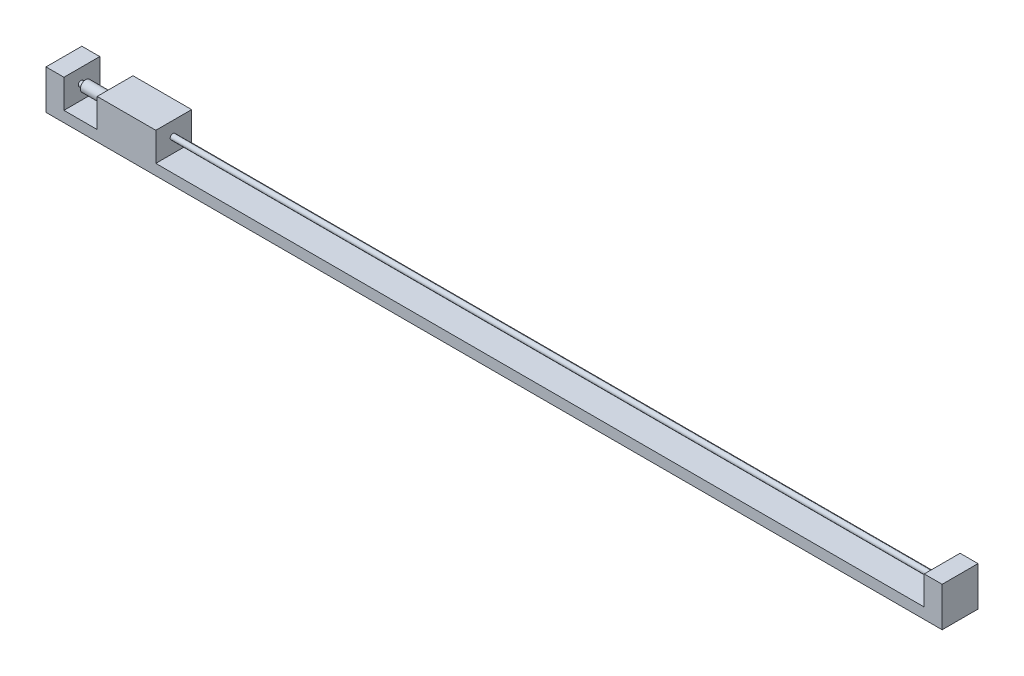
ISO-10303-21;
HEADER;
FILE_DESCRIPTION(('STEP AP214'),'2;1');
FILE_NAME('part.step','',(''),(''),'','','');
FILE_SCHEMA(('AUTOMOTIVE_DESIGN { 1 0 10303 214 1 1 1 1 }'));
ENDSEC;
DATA;
#1=APPLICATION_CONTEXT('core data for automotive mechanical design processes');
#2=APPLICATION_PROTOCOL_DEFINITION('international standard','automotive_design',2000,#1);
#3=PRODUCT_CONTEXT('',#1,'mechanical');
#4=PRODUCT('Part','Part','',(#3));
#5=PRODUCT_RELATED_PRODUCT_CATEGORY('part','',(#4));
#6=PRODUCT_DEFINITION_FORMATION('','',#4);
#7=PRODUCT_DEFINITION_CONTEXT('part definition',#1,'design');
#8=PRODUCT_DEFINITION('design','',#6,#7);
#9=PRODUCT_DEFINITION_SHAPE('','',#8);
#10=(LENGTH_UNIT() NAMED_UNIT(*) SI_UNIT(.MILLI.,.METRE.));
#11=(NAMED_UNIT(*) PLANE_ANGLE_UNIT() SI_UNIT($,.RADIAN.));
#12=(NAMED_UNIT(*) SI_UNIT($,.STERADIAN.) SOLID_ANGLE_UNIT());
#13=UNCERTAINTY_MEASURE_WITH_UNIT(LENGTH_MEASURE(1.E-05),#10,'distance_accuracy_value','');
#14=(GEOMETRIC_REPRESENTATION_CONTEXT(3) GLOBAL_UNCERTAINTY_ASSIGNED_CONTEXT((#13)) GLOBAL_UNIT_ASSIGNED_CONTEXT((#10,
#11,#12)) REPRESENTATION_CONTEXT('',''));
#15=CARTESIAN_POINT('',(0.,0.,0.));
#16=DIRECTION('',(0.,0.,1.));
#17=DIRECTION('',(1.,0.,0.));
#18=AXIS2_PLACEMENT_3D('',#15,#16,#17);
#19=CARTESIAN_POINT('',(14.2707220254308,11.,-10.));
#20=DIRECTION('',(1.,0.,0.));
#21=DIRECTION('',(0.,0.,-1.));
#22=AXIS2_PLACEMENT_3D('',#19,#20,#21);
#23=PLANE('',#22);
#24=CARTESIAN_POINT('',(14.2707220254308,7.10077280639586,-4.7549055990206));
#25=DIRECTION('',(1.,0.,0.));
#26=DIRECTION('',(0.,0.,-1.));
#27=AXIS2_PLACEMENT_3D('',#24,#25,#26);
#28=CIRCLE('',#27,0.75);
#29=CARTESIAN_POINT('',(14.2707220254308,7.10077280639586,-5.5049055990206));
#30=VERTEX_POINT('',#29);
#31=EDGE_CURVE('E48',#30,#30,#28,.T.);
#32=ORIENTED_EDGE('',*,*,#31,.T.);
#33=EDGE_LOOP('',(#32));
#34=FACE_BOUND('',#33,.T.);
#35=CARTESIAN_POINT('',(14.2707220254308,7.16204640664232,-4.80086079920424));
#36=DIRECTION('',(-1.,0.,0.));
#37=DIRECTION('',(0.,0.,1.));
#38=AXIS2_PLACEMENT_3D('',#35,#36,#37);
#39=CIRCLE('',#38,1.15336464905424);
#40=CARTESIAN_POINT('',(14.2707220254308,7.16204640664232,-3.64749615015));
#41=VERTEX_POINT('',#40);
#42=EDGE_CURVE('E508',#41,#41,#39,.T.);
#43=ORIENTED_EDGE('',*,*,#42,.T.);
#44=EDGE_LOOP('',(#43));
#45=FACE_BOUND('',#44,.T.);
#46=ADVANCED_FACE('F39',(#34,#45),#23,.F.);
#47=CARTESIAN_POINT('',(0.,3.,0.));
#48=DIRECTION('',(0.,-1.,0.));
#49=DIRECTION('',(0.,0.,-1.));
#50=AXIS2_PLACEMENT_3D('',#47,#48,#49);
#51=PLANE('',#50);
#52=DIRECTION('',(0.,0.,1.));
#53=VECTOR('',#52,1.);
#54=CARTESIAN_POINT('',(14.2707220254308,3.,-10.));
#55=LINE('',#54,#53);
#56=CARTESIAN_POINT('',(14.2707220254308,3.,-10.));
#57=VERTEX_POINT('',#56);
#58=CARTESIAN_POINT('',(14.2707220254308,3.,0.));
#59=VERTEX_POINT('',#58);
#60=EDGE_CURVE('E153',#57,#59,#55,.T.);
#61=ORIENTED_EDGE('',*,*,#60,.F.);
#62=DIRECTION('',(-1.,0.,0.));
#63=VECTOR('',#62,1.);
#64=CARTESIAN_POINT('',(0.,3.,-10.));
#65=LINE('',#64,#63);
#66=CARTESIAN_POINT('',(5.,3.,-10.));
#67=VERTEX_POINT('',#66);
#68=EDGE_CURVE('E216',#57,#67,#65,.T.);
#69=ORIENTED_EDGE('',*,*,#68,.T.);
#70=DIRECTION('',(0.,0.,-1.));
#71=VECTOR('',#70,1.);
#72=CARTESIAN_POINT('',(5.,3.,0.));
#73=LINE('',#72,#71);
#74=CARTESIAN_POINT('',(5.,3.,0.));
#75=VERTEX_POINT('',#74);
#76=EDGE_CURVE('E187',#75,#67,#73,.T.);
#77=ORIENTED_EDGE('',*,*,#76,.F.);
#78=DIRECTION('',(1.,0.,0.));
#79=VECTOR('',#78,1.);
#80=CARTESIAN_POINT('',(0.,3.,0.));
#81=LINE('',#80,#79);
#82=EDGE_CURVE('E63',#75,#59,#81,.T.);
#83=ORIENTED_EDGE('',*,*,#82,.T.);
#84=EDGE_LOOP('',(#61,#69,#77,#83));
#85=FACE_BOUND('',#84,.T.);
#86=ADVANCED_FACE('F277',(#85),#51,.F.);
#87=DIRECTION('',(0.,0.,-1.));
#88=VECTOR('',#87,1.);
#89=CARTESIAN_POINT('',(30.6304272746044,3.,-10.));
#90=LINE('',#89,#88);
#91=CARTESIAN_POINT('',(30.6304272746044,3.,0.));
#92=VERTEX_POINT('',#91);
#93=CARTESIAN_POINT('',(30.6304272746044,3.,-10.));
#94=VERTEX_POINT('',#93);
#95=EDGE_CURVE('E55',#92,#94,#90,.T.);
#96=ORIENTED_EDGE('',*,*,#95,.F.);
#97=CARTESIAN_POINT('',(245.,3.,0.));
#98=VERTEX_POINT('',#97);
#99=EDGE_CURVE('E217',#92,#98,#81,.T.);
#100=ORIENTED_EDGE('',*,*,#99,.T.);
#101=DIRECTION('',(0.,0.,1.));
#102=VECTOR('',#101,1.);
#103=CARTESIAN_POINT('',(245.,3.,-10.));
#104=LINE('',#103,#102);
#105=CARTESIAN_POINT('',(245.,3.,-10.));
#106=VERTEX_POINT('',#105);
#107=EDGE_CURVE('E155',#106,#98,#104,.T.);
#108=ORIENTED_EDGE('',*,*,#107,.F.);
#109=EDGE_CURVE('E218',#106,#94,#65,.T.);
#110=ORIENTED_EDGE('',*,*,#109,.T.);
#111=EDGE_LOOP('',(#96,#100,#108,#110));
#112=FACE_BOUND('',#111,.T.);
#113=ADVANCED_FACE('F269',(#112),#51,.F.);
#114=CARTESIAN_POINT('',(250.002,7.10077280639586,-4.7549055990206));
#115=DIRECTION('',(-1.,0.,0.));
#116=DIRECTION('',(0.,0.,1.));
#117=AXIS2_PLACEMENT_3D('',#114,#115,#116);
#118=CYLINDRICAL_SURFACE('',#117,0.75);
#119=CARTESIAN_POINT('',(5.,7.10077280639586,-4.7549055990206));
#120=DIRECTION('',(-1.,0.,0.));
#121=DIRECTION('',(0.,0.,1.));
#122=AXIS2_PLACEMENT_3D('',#119,#120,#121);
#123=CIRCLE('',#122,0.75);
#124=CARTESIAN_POINT('',(5.,7.10077280639586,-4.0049055990206));
#125=VERTEX_POINT('',#124);
#126=EDGE_CURVE('E253',#125,#125,#123,.F.);
#127=ORIENTED_EDGE('',*,*,#126,.T.);
#128=EDGE_LOOP('',(#127));
#129=FACE_BOUND('',#128,.T.);
#130=ORIENTED_EDGE('',*,*,#31,.F.);
#131=EDGE_LOOP('',(#130));
#132=FACE_BOUND('',#131,.T.);
#133=ADVANCED_FACE('F266',(#129,#132),#118,.T.);
#134=CARTESIAN_POINT('',(245.,7.10077280639586,-4.7549055990206));
#135=DIRECTION('',(1.,0.,0.));
#136=DIRECTION('',(0.,0.,-1.));
#137=AXIS2_PLACEMENT_3D('',#134,#135,#136);
#138=CIRCLE('',#137,0.75);
#139=CARTESIAN_POINT('',(245.,7.10077280639586,-5.5049055990206));
#140=VERTEX_POINT('',#139);
#141=EDGE_CURVE('E249',#140,#140,#138,.F.);
#142=ORIENTED_EDGE('',*,*,#141,.T.);
#143=EDGE_LOOP('',(#142));
#144=FACE_BOUND('',#143,.T.);
#145=CARTESIAN_POINT('',(30.6304272746044,7.10077280639586,-4.7549055990206));
#146=DIRECTION('',(-1.,0.,0.));
#147=DIRECTION('',(0.,0.,1.));
#148=AXIS2_PLACEMENT_3D('',#145,#146,#147);
#149=CIRCLE('',#148,0.75);
#150=CARTESIAN_POINT('',(30.6304272746044,7.10077280639586,-4.0049055990206));
#151=VERTEX_POINT('',#150);
#152=EDGE_CURVE('E257',#151,#151,#149,.T.);
#153=ORIENTED_EDGE('',*,*,#152,.F.);
#154=EDGE_LOOP('',(#153));
#155=FACE_BOUND('',#154,.T.);
#156=ADVANCED_FACE('F268',(#144,#155),#118,.T.);
#157=CARTESIAN_POINT('',(0.,3.,0.));
#158=DIRECTION('',(1.,0.,0.));
#159=DIRECTION('',(0.,0.,-1.));
#160=AXIS2_PLACEMENT_3D('',#157,#158,#159);
#161=PLANE('',#160);
#162=DIRECTION('',(0.,0.,1.));
#163=VECTOR('',#162,1.);
#164=CARTESIAN_POINT('',(0.,0.,0.));
#165=LINE('',#164,#163);
#166=CARTESIAN_POINT('',(0.,0.,-10.));
#167=VERTEX_POINT('',#166);
#168=CARTESIAN_POINT('',(0.,0.,0.));
#169=VERTEX_POINT('',#168);
#170=EDGE_CURVE('E213',#167,#169,#165,.T.);
#171=ORIENTED_EDGE('',*,*,#170,.T.);
#172=DIRECTION('',(0.,-1.,0.));
#173=VECTOR('',#172,1.);
#174=CARTESIAN_POINT('',(0.,3.,0.));
#175=LINE('',#174,#173);
#176=CARTESIAN_POINT('',(0.,11.,0.));
#177=VERTEX_POINT('',#176);
#178=EDGE_CURVE('E245',#177,#169,#175,.T.);
#179=ORIENTED_EDGE('',*,*,#178,.F.);
#180=DIRECTION('',(0.,0.,1.));
#181=VECTOR('',#180,1.);
#182=CARTESIAN_POINT('',(0.,11.,0.));
#183=LINE('',#182,#181);
#184=CARTESIAN_POINT('',(0.,11.,-10.));
#185=VERTEX_POINT('',#184);
#186=EDGE_CURVE('E188',#185,#177,#183,.T.);
#187=ORIENTED_EDGE('',*,*,#186,.F.);
#188=DIRECTION('',(0.,-1.,0.));
#189=VECTOR('',#188,1.);
#190=CARTESIAN_POINT('',(0.,3.,-10.));
#191=LINE('',#190,#189);
#192=EDGE_CURVE('E221',#185,#167,#191,.T.);
#193=ORIENTED_EDGE('',*,*,#192,.T.);
#194=EDGE_LOOP('',(#171,#179,#187,#193));
#195=FACE_BOUND('',#194,.T.);
#196=ADVANCED_FACE('F41',(#195),#161,.F.);
#197=CARTESIAN_POINT('',(0.,3.,0.));
#198=DIRECTION('',(0.,0.,-1.));
#199=DIRECTION('',(-1.,0.,0.));
#200=AXIS2_PLACEMENT_3D('',#197,#198,#199);
#201=PLANE('',#200);
#202=DIRECTION('',(1.,0.,0.));
#203=VECTOR('',#202,1.);
#204=CARTESIAN_POINT('',(0.,0.,0.));
#205=LINE('',#204,#203);
#206=CARTESIAN_POINT('',(250.,0.,0.));
#207=VERTEX_POINT('',#206);
#208=EDGE_CURVE('E225',#169,#207,#205,.T.);
#209=ORIENTED_EDGE('',*,*,#208,.T.);
#210=DIRECTION('',(0.,-1.,0.));
#211=VECTOR('',#210,1.);
#212=CARTESIAN_POINT('',(250.,3.,0.));
#213=LINE('',#212,#211);
#214=CARTESIAN_POINT('',(250.,11.,0.));
#215=VERTEX_POINT('',#214);
#216=EDGE_CURVE('E241',#215,#207,#213,.T.);
#217=ORIENTED_EDGE('',*,*,#216,.F.);
#218=DIRECTION('',(1.,0.,0.));
#219=VECTOR('',#218,1.);
#220=CARTESIAN_POINT('',(250.,11.,0.));
#221=LINE('',#220,#219);
#222=CARTESIAN_POINT('',(245.,11.,0.));
#223=VERTEX_POINT('',#222);
#224=EDGE_CURVE('E175',#223,#215,#221,.T.);
#225=ORIENTED_EDGE('',*,*,#224,.F.);
#226=DIRECTION('',(0.,-1.,0.));
#227=VECTOR('',#226,1.);
#228=CARTESIAN_POINT('',(245.,11.,0.));
#229=LINE('',#228,#227);
#230=EDGE_CURVE('E178',#223,#98,#229,.T.);
#231=ORIENTED_EDGE('',*,*,#230,.T.);
#232=ORIENTED_EDGE('',*,*,#99,.F.);
#233=DIRECTION('',(0.,-1.,0.));
#234=VECTOR('',#233,1.);
#235=CARTESIAN_POINT('',(30.6304272746044,11.,0.));
#236=LINE('',#235,#234);
#237=CARTESIAN_POINT('',(30.6304272746044,11.,0.));
#238=VERTEX_POINT('',#237);
#239=EDGE_CURVE('E136',#238,#92,#236,.T.);
#240=ORIENTED_EDGE('',*,*,#239,.F.);
#241=DIRECTION('',(1.,0.,0.));
#242=VECTOR('',#241,1.);
#243=CARTESIAN_POINT('',(14.2707220254308,11.,0.));
#244=LINE('',#243,#242);
#245=CARTESIAN_POINT('',(14.2707220254308,11.,0.));
#246=VERTEX_POINT('',#245);
#247=EDGE_CURVE('E129',#246,#238,#244,.T.);
#248=ORIENTED_EDGE('',*,*,#247,.F.);
#249=DIRECTION('',(0.,-1.,0.));
#250=VECTOR('',#249,1.);
#251=CARTESIAN_POINT('',(14.2707220254308,11.,0.));
#252=LINE('',#251,#250);
#253=EDGE_CURVE('E133',#246,#59,#252,.T.);
#254=ORIENTED_EDGE('',*,*,#253,.T.);
#255=ORIENTED_EDGE('',*,*,#82,.F.);
#256=DIRECTION('',(0.,-1.,0.));
#257=VECTOR('',#256,1.);
#258=CARTESIAN_POINT('',(5.,11.,0.));
#259=LINE('',#258,#257);
#260=CARTESIAN_POINT('',(5.,11.,0.));
#261=VERTEX_POINT('',#260);
#262=EDGE_CURVE('E209',#261,#75,#259,.T.);
#263=ORIENTED_EDGE('',*,*,#262,.F.);
#264=DIRECTION('',(1.,0.,0.));
#265=VECTOR('',#264,1.);
#266=CARTESIAN_POINT('',(0.,11.,0.));
#267=LINE('',#266,#265);
#268=EDGE_CURVE('E192',#177,#261,#267,.T.);
#269=ORIENTED_EDGE('',*,*,#268,.F.);
#270=ORIENTED_EDGE('',*,*,#178,.T.);
#271=EDGE_LOOP('',(#209,#217,#225,#231,#232,#240,#248,#254,#255,#263,#269,#270));
#272=FACE_BOUND('',#271,.T.);
#273=ADVANCED_FACE('F131',(#272),#201,.F.);
#274=CARTESIAN_POINT('',(250.,3.,0.));
#275=DIRECTION('',(-1.,0.,0.));
#276=DIRECTION('',(0.,0.,1.));
#277=AXIS2_PLACEMENT_3D('',#274,#275,#276);
#278=PLANE('',#277);
#279=DIRECTION('',(0.,0.,-1.));
#280=VECTOR('',#279,1.);
#281=CARTESIAN_POINT('',(250.,0.,0.));
#282=LINE('',#281,#280);
#283=CARTESIAN_POINT('',(250.,0.,-10.));
#284=VERTEX_POINT('',#283);
#285=EDGE_CURVE('E228',#207,#284,#282,.T.);
#286=ORIENTED_EDGE('',*,*,#285,.T.);
#287=DIRECTION('',(0.,-1.,0.));
#288=VECTOR('',#287,1.);
#289=CARTESIAN_POINT('',(250.,3.,-10.));
#290=LINE('',#289,#288);
#291=CARTESIAN_POINT('',(250.,11.,-10.));
#292=VERTEX_POINT('',#291);
#293=EDGE_CURVE('E237',#292,#284,#290,.T.);
#294=ORIENTED_EDGE('',*,*,#293,.F.);
#295=DIRECTION('',(0.,0.,-1.));
#296=VECTOR('',#295,1.);
#297=CARTESIAN_POINT('',(250.,11.,-10.));
#298=LINE('',#297,#296);
#299=EDGE_CURVE('E160',#215,#292,#298,.T.);
#300=ORIENTED_EDGE('',*,*,#299,.F.);
#301=ORIENTED_EDGE('',*,*,#216,.T.);
#302=EDGE_LOOP('',(#286,#294,#300,#301));
#303=FACE_BOUND('',#302,.T.);
#304=ADVANCED_FACE('F359',(#303),#278,.F.);
#305=CARTESIAN_POINT('',(0.,3.,-10.));
#306=DIRECTION('',(0.,0.,1.));
#307=DIRECTION('',(1.,0.,0.));
#308=AXIS2_PLACEMENT_3D('',#305,#306,#307);
#309=PLANE('',#308);
#310=DIRECTION('',(-1.,0.,0.));
#311=VECTOR('',#310,1.);
#312=CARTESIAN_POINT('',(0.,0.,-10.));
#313=LINE('',#312,#311);
#314=EDGE_CURVE('E231',#284,#167,#313,.T.);
#315=ORIENTED_EDGE('',*,*,#314,.T.);
#316=ORIENTED_EDGE('',*,*,#192,.F.);
#317=DIRECTION('',(-1.,0.,0.));
#318=VECTOR('',#317,1.);
#319=CARTESIAN_POINT('',(0.,11.,-10.));
#320=LINE('',#319,#318);
#321=CARTESIAN_POINT('',(5.,11.,-10.));
#322=VERTEX_POINT('',#321);
#323=EDGE_CURVE('E198',#322,#185,#320,.T.);
#324=ORIENTED_EDGE('',*,*,#323,.F.);
#325=DIRECTION('',(0.,-1.,0.));
#326=VECTOR('',#325,1.);
#327=CARTESIAN_POINT('',(5.,11.,-10.));
#328=LINE('',#327,#326);
#329=EDGE_CURVE('E202',#322,#67,#328,.T.);
#330=ORIENTED_EDGE('',*,*,#329,.T.);
#331=ORIENTED_EDGE('',*,*,#68,.F.);
#332=DIRECTION('',(0.,-1.,0.));
#333=VECTOR('',#332,1.);
#334=CARTESIAN_POINT('',(14.2707220254308,11.,-10.));
#335=LINE('',#334,#333);
#336=CARTESIAN_POINT('',(14.2707220254308,11.,-10.));
#337=VERTEX_POINT('',#336);
#338=EDGE_CURVE('E488',#337,#57,#335,.T.);
#339=ORIENTED_EDGE('',*,*,#338,.F.);
#340=DIRECTION('',(-1.,0.,0.));
#341=VECTOR('',#340,1.);
#342=CARTESIAN_POINT('',(14.2707220254308,11.,-10.));
#343=LINE('',#342,#341);
#344=CARTESIAN_POINT('',(30.6304272746044,11.,-10.));
#345=VERTEX_POINT('',#344);
#346=EDGE_CURVE('E146',#345,#337,#343,.T.);
#347=ORIENTED_EDGE('',*,*,#346,.F.);
#348=DIRECTION('',(0.,-1.,0.));
#349=VECTOR('',#348,1.);
#350=CARTESIAN_POINT('',(30.6304272746044,11.,-10.));
#351=LINE('',#350,#349);
#352=EDGE_CURVE('E162',#345,#94,#351,.T.);
#353=ORIENTED_EDGE('',*,*,#352,.T.);
#354=ORIENTED_EDGE('',*,*,#109,.F.);
#355=DIRECTION('',(0.,-1.,0.));
#356=VECTOR('',#355,1.);
#357=CARTESIAN_POINT('',(245.,11.,-10.));
#358=LINE('',#357,#356);
#359=CARTESIAN_POINT('',(245.,11.,-10.));
#360=VERTEX_POINT('',#359);
#361=EDGE_CURVE('E183',#360,#106,#358,.T.);
#362=ORIENTED_EDGE('',*,*,#361,.F.);
#363=DIRECTION('',(-1.,0.,0.));
#364=VECTOR('',#363,1.);
#365=CARTESIAN_POINT('',(250.,11.,-10.));
#366=LINE('',#365,#364);
#367=EDGE_CURVE('E169',#292,#360,#366,.T.);
#368=ORIENTED_EDGE('',*,*,#367,.F.);
#369=ORIENTED_EDGE('',*,*,#293,.T.);
#370=EDGE_LOOP('',(#315,#316,#324,#330,#331,#339,#347,#353,#354,#362,#368,#369));
#371=FACE_BOUND('',#370,.T.);
#372=ADVANCED_FACE('F354',(#371),#309,.F.);
#373=CARTESIAN_POINT('',(0.,0.,0.));
#374=DIRECTION('',(0.,-1.,0.));
#375=DIRECTION('',(0.,0.,-1.));
#376=AXIS2_PLACEMENT_3D('',#373,#374,#375);
#377=PLANE('',#376);
#378=ORIENTED_EDGE('',*,*,#170,.F.);
#379=ORIENTED_EDGE('',*,*,#314,.F.);
#380=ORIENTED_EDGE('',*,*,#285,.F.);
#381=ORIENTED_EDGE('',*,*,#208,.F.);
#382=EDGE_LOOP('',(#378,#379,#380,#381));
#383=FACE_BOUND('',#382,.T.);
#384=ADVANCED_FACE('F358',(#383),#377,.T.);
#385=CARTESIAN_POINT('',(5.,11.,0.));
#386=DIRECTION('',(-1.,0.,0.));
#387=DIRECTION('',(0.,0.,1.));
#388=AXIS2_PLACEMENT_3D('',#385,#386,#387);
#389=PLANE('',#388);
#390=ORIENTED_EDGE('',*,*,#126,.F.);
#391=EDGE_LOOP('',(#390));
#392=FACE_BOUND('',#391,.T.);
#393=ORIENTED_EDGE('',*,*,#76,.T.);
#394=ORIENTED_EDGE('',*,*,#329,.F.);
#395=DIRECTION('',(0.,0.,-1.));
#396=VECTOR('',#395,1.);
#397=CARTESIAN_POINT('',(5.,11.,0.));
#398=LINE('',#397,#396);
#399=EDGE_CURVE('E195',#261,#322,#398,.T.);
#400=ORIENTED_EDGE('',*,*,#399,.F.);
#401=ORIENTED_EDGE('',*,*,#262,.T.);
#402=EDGE_LOOP('',(#393,#394,#400,#401));
#403=FACE_BOUND('',#402,.T.);
#404=ADVANCED_FACE('F412',(#392,#403),#389,.F.);
#405=CARTESIAN_POINT('',(0.,11.,0.));
#406=DIRECTION('',(0.,-1.,0.));
#407=DIRECTION('',(0.,0.,-1.));
#408=AXIS2_PLACEMENT_3D('',#405,#406,#407);
#409=PLANE('',#408);
#410=ORIENTED_EDGE('',*,*,#186,.T.);
#411=ORIENTED_EDGE('',*,*,#268,.T.);
#412=ORIENTED_EDGE('',*,*,#399,.T.);
#413=ORIENTED_EDGE('',*,*,#323,.T.);
#414=EDGE_LOOP('',(#410,#411,#412,#413));
#415=FACE_BOUND('',#414,.T.);
#416=ADVANCED_FACE('F404',(#415),#409,.F.);
#417=CARTESIAN_POINT('',(245.,11.,-10.));
#418=DIRECTION('',(1.,0.,0.));
#419=DIRECTION('',(0.,0.,-1.));
#420=AXIS2_PLACEMENT_3D('',#417,#418,#419);
#421=PLANE('',#420);
#422=ORIENTED_EDGE('',*,*,#141,.F.);
#423=EDGE_LOOP('',(#422));
#424=FACE_BOUND('',#423,.T.);
#425=ORIENTED_EDGE('',*,*,#107,.T.);
#426=ORIENTED_EDGE('',*,*,#230,.F.);
#427=DIRECTION('',(0.,0.,1.));
#428=VECTOR('',#427,1.);
#429=CARTESIAN_POINT('',(245.,11.,-10.));
#430=LINE('',#429,#428);
#431=EDGE_CURVE('E172',#360,#223,#430,.T.);
#432=ORIENTED_EDGE('',*,*,#431,.F.);
#433=ORIENTED_EDGE('',*,*,#361,.T.);
#434=EDGE_LOOP('',(#425,#426,#432,#433));
#435=FACE_BOUND('',#434,.T.);
#436=ADVANCED_FACE('F295',(#424,#435),#421,.F.);
#437=CARTESIAN_POINT('',(0.,11.,0.));
#438=DIRECTION('',(0.,-1.,0.));
#439=DIRECTION('',(0.,0.,-1.));
#440=AXIS2_PLACEMENT_3D('',#437,#438,#439);
#441=PLANE('',#440);
#442=ORIENTED_EDGE('',*,*,#299,.T.);
#443=ORIENTED_EDGE('',*,*,#367,.T.);
#444=ORIENTED_EDGE('',*,*,#431,.T.);
#445=ORIENTED_EDGE('',*,*,#224,.T.);
#446=EDGE_LOOP('',(#442,#443,#444,#445));
#447=FACE_BOUND('',#446,.T.);
#448=ADVANCED_FACE('F288',(#447),#441,.F.);
#449=CARTESIAN_POINT('',(14.2707220254308,7.16204640664232,-4.80086079920424));
#450=DIRECTION('',(1.,0.,0.));
#451=DIRECTION('',(0.,0.,-1.));
#452=AXIS2_PLACEMENT_3D('',#449,#450,#451);
#453=CIRCLE('',#452,1.49564390002775);
#454=CARTESIAN_POINT('',(14.2707220254308,7.16204640664232,-6.29650469923199));
#455=VERTEX_POINT('',#454);
#456=EDGE_CURVE('E11',#455,#455,#453,.F.);
#457=ORIENTED_EDGE('',*,*,#456,.F.);
#458=EDGE_LOOP('',(#457));
#459=FACE_BOUND('',#458,.T.);
#460=ORIENTED_EDGE('',*,*,#60,.T.);
#461=ORIENTED_EDGE('',*,*,#253,.F.);
#462=DIRECTION('',(0.,0.,1.));
#463=VECTOR('',#462,1.);
#464=CARTESIAN_POINT('',(14.2707220254308,11.,-10.));
#465=LINE('',#464,#463);
#466=EDGE_CURVE('E141',#337,#246,#465,.T.);
#467=ORIENTED_EDGE('',*,*,#466,.F.);
#468=ORIENTED_EDGE('',*,*,#338,.T.);
#469=EDGE_LOOP('',(#460,#461,#467,#468));
#470=FACE_BOUND('',#469,.T.);
#471=ADVANCED_FACE('F152',(#459,#470),#23,.F.);
#472=CARTESIAN_POINT('',(30.6304272746044,11.,-10.));
#473=DIRECTION('',(-1.,0.,0.));
#474=DIRECTION('',(0.,0.,1.));
#475=AXIS2_PLACEMENT_3D('',#472,#473,#474);
#476=PLANE('',#475);
#477=ORIENTED_EDGE('',*,*,#152,.T.);
#478=EDGE_LOOP('',(#477));
#479=FACE_BOUND('',#478,.T.);
#480=ORIENTED_EDGE('',*,*,#95,.T.);
#481=ORIENTED_EDGE('',*,*,#352,.F.);
#482=DIRECTION('',(0.,0.,-1.));
#483=VECTOR('',#482,1.);
#484=CARTESIAN_POINT('',(30.6304272746044,11.,-10.));
#485=LINE('',#484,#483);
#486=EDGE_CURVE('E140',#238,#345,#485,.T.);
#487=ORIENTED_EDGE('',*,*,#486,.F.);
#488=ORIENTED_EDGE('',*,*,#239,.T.);
#489=EDGE_LOOP('',(#480,#481,#487,#488));
#490=FACE_BOUND('',#489,.T.);
#491=ADVANCED_FACE('F287',(#479,#490),#476,.F.);
#492=CARTESIAN_POINT('',(0.,11.,0.));
#493=DIRECTION('',(0.,1.,0.));
#494=DIRECTION('',(0.,0.,1.));
#495=AXIS2_PLACEMENT_3D('',#492,#493,#494);
#496=PLANE('',#495);
#497=ORIENTED_EDGE('',*,*,#466,.T.);
#498=ORIENTED_EDGE('',*,*,#247,.T.);
#499=ORIENTED_EDGE('',*,*,#486,.T.);
#500=ORIENTED_EDGE('',*,*,#346,.T.);
#501=EDGE_LOOP('',(#497,#498,#499,#500));
#502=FACE_BOUND('',#501,.T.);
#503=ADVANCED_FACE('F144',(#502),#496,.T.);
#504=CARTESIAN_POINT('',(6.27072202543078,7.16204640664232,-4.80086079920424));
#505=DIRECTION('',(-1.,0.,0.));
#506=DIRECTION('',(0.,0.,1.));
#507=AXIS2_PLACEMENT_3D('',#504,#505,#506);
#508=PLANE('',#507);
#509=CARTESIAN_POINT('',(6.27072202543078,7.16204640664232,-4.80086079920424));
#510=DIRECTION('',(-1.,0.,0.));
#511=DIRECTION('',(0.,0.,1.));
#512=AXIS2_PLACEMENT_3D('',#509,#510,#511);
#513=CIRCLE('',#512,1.49564390002775);
#514=CARTESIAN_POINT('',(6.27072202543078,7.16204640664232,-3.30521689917649));
#515=VERTEX_POINT('',#514);
#516=EDGE_CURVE('E491',#515,#515,#513,.T.);
#517=ORIENTED_EDGE('',*,*,#516,.T.);
#518=EDGE_LOOP('',(#517));
#519=FACE_BOUND('',#518,.T.);
#520=CARTESIAN_POINT('',(6.27072202543078,7.16204640664232,-4.80086079920424));
#521=DIRECTION('',(-1.,0.,0.));
#522=DIRECTION('',(0.,0.,1.));
#523=AXIS2_PLACEMENT_3D('',#520,#521,#522);
#524=CIRCLE('',#523,1.15336464905424);
#525=CARTESIAN_POINT('',(6.27072202543078,7.16204640664232,-3.64749615015));
#526=VERTEX_POINT('',#525);
#527=EDGE_CURVE('E507',#526,#526,#524,.T.);
#528=ORIENTED_EDGE('',*,*,#527,.F.);
#529=EDGE_LOOP('',(#528));
#530=FACE_BOUND('',#529,.T.);
#531=ADVANCED_FACE('F302',(#519,#530),#508,.T.);
#532=CARTESIAN_POINT('',(6.27072202543078,7.16204640664232,-4.80086079920424));
#533=DIRECTION('',(1.,0.,0.));
#534=DIRECTION('',(0.,0.,-1.));
#535=AXIS2_PLACEMENT_3D('',#532,#533,#534);
#536=CYLINDRICAL_SURFACE('',#535,1.49564390002775);
#537=ORIENTED_EDGE('',*,*,#516,.F.);
#538=EDGE_LOOP('',(#537));
#539=FACE_BOUND('',#538,.T.);
#540=ORIENTED_EDGE('',*,*,#456,.T.);
#541=EDGE_LOOP('',(#540));
#542=FACE_BOUND('',#541,.T.);
#543=ADVANCED_FACE('F299',(#539,#542),#536,.T.);
#544=CARTESIAN_POINT('',(6.27072202543078,7.16204640664232,-4.80086079920424));
#545=DIRECTION('',(1.,0.,0.));
#546=DIRECTION('',(0.,0.,-1.));
#547=AXIS2_PLACEMENT_3D('',#544,#545,#546);
#548=CYLINDRICAL_SURFACE('',#547,1.15336464905424);
#549=ORIENTED_EDGE('',*,*,#527,.T.);
#550=EDGE_LOOP('',(#549));
#551=FACE_BOUND('',#550,.T.);
#552=ORIENTED_EDGE('',*,*,#42,.F.);
#553=EDGE_LOOP('',(#552));
#554=FACE_BOUND('',#553,.T.);
#555=ADVANCED_FACE('F301',(#551,#554),#548,.F.);
#556=CLOSED_SHELL('',(#46,#86,#113,#133,#156,#196,#273,#304,#372,#384,#404,#416,#436,#448,#471,
#491,#503,#531,#543,#555));
#557=MANIFOLD_SOLID_BREP('B2',#556);
#558=ADVANCED_BREP_SHAPE_REPRESENTATION('',(#18,#557),#14);
#559=SHAPE_DEFINITION_REPRESENTATION(#9,#558);
ENDSEC;
END-ISO-10303-21;
